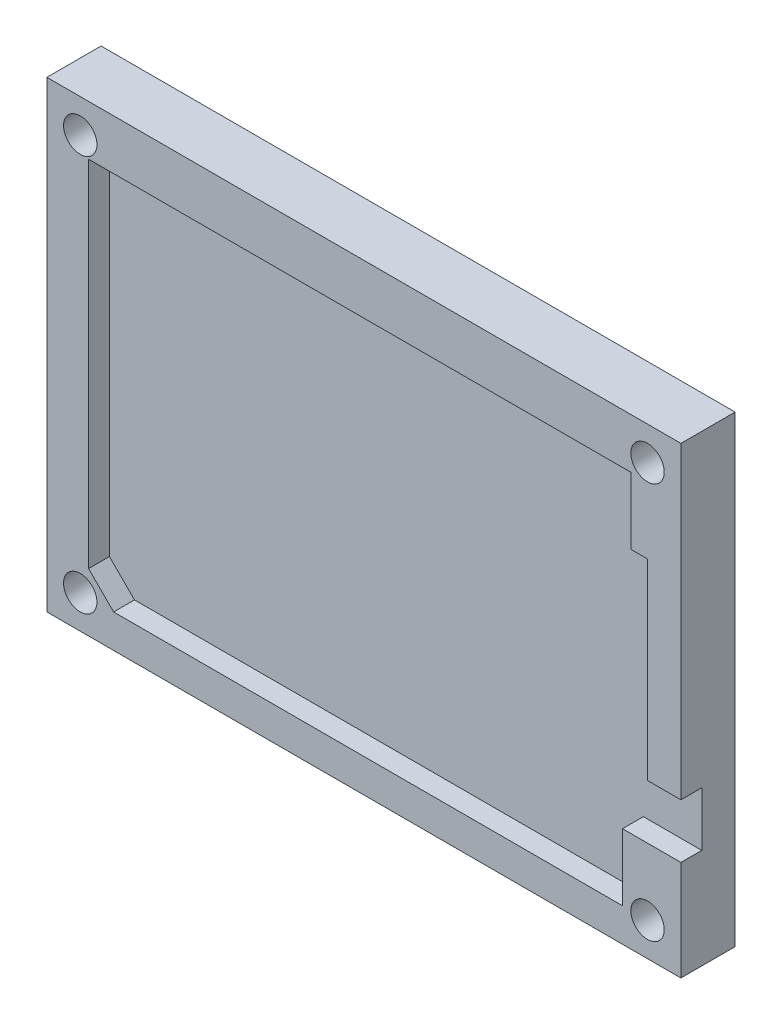
ISO-10303-21;
HEADER;
FILE_DESCRIPTION(('STEP AP214'),'2;1');
FILE_NAME('part.step','',(''),(''),'','','');
FILE_SCHEMA(('AUTOMOTIVE_DESIGN { 1 0 10303 214 1 1 1 1 }'));
ENDSEC;
DATA;
#1=APPLICATION_CONTEXT('core data for automotive mechanical design processes');
#2=APPLICATION_PROTOCOL_DEFINITION('international standard','automotive_design',2000,#1);
#3=PRODUCT_CONTEXT('',#1,'mechanical');
#4=PRODUCT('Part','Part','',(#3));
#5=PRODUCT_RELATED_PRODUCT_CATEGORY('part','',(#4));
#6=PRODUCT_DEFINITION_FORMATION('','',#4);
#7=PRODUCT_DEFINITION_CONTEXT('part definition',#1,'design');
#8=PRODUCT_DEFINITION('design','',#6,#7);
#9=PRODUCT_DEFINITION_SHAPE('','',#8);
#10=(LENGTH_UNIT() NAMED_UNIT(*) SI_UNIT(.MILLI.,.METRE.));
#11=(NAMED_UNIT(*) PLANE_ANGLE_UNIT() SI_UNIT($,.RADIAN.));
#12=(NAMED_UNIT(*) SI_UNIT($,.STERADIAN.) SOLID_ANGLE_UNIT());
#13=UNCERTAINTY_MEASURE_WITH_UNIT(LENGTH_MEASURE(1.E-05),#10,'distance_accuracy_value','');
#14=(GEOMETRIC_REPRESENTATION_CONTEXT(3) GLOBAL_UNCERTAINTY_ASSIGNED_CONTEXT((#13)) GLOBAL_UNIT_ASSIGNED_CONTEXT((#10,
#11,#12)) REPRESENTATION_CONTEXT('',''));
#15=CARTESIAN_POINT('',(0.,0.,0.));
#16=DIRECTION('',(0.,0.,1.));
#17=DIRECTION('',(1.,0.,0.));
#18=AXIS2_PLACEMENT_3D('',#15,#16,#17);
#19=CARTESIAN_POINT('',(-38.3610451306413,22.1591448931116,4.));
#20=DIRECTION('',(1.,0.,0.));
#21=DIRECTION('',(0.,1.,0.));
#22=AXIS2_PLACEMENT_3D('',#19,#20,#21);
#23=PLANE('',#22);
#24=DIRECTION('',(0.,-1.,0.));
#25=VECTOR('',#24,1.);
#26=CARTESIAN_POINT('',(-38.3610451306413,22.1591448931116,0.));
#27=LINE('',#26,#25);
#28=CARTESIAN_POINT('',(-38.3610451306413,22.1591448931116,0.));
#29=VERTEX_POINT('',#28);
#30=CARTESIAN_POINT('',(-38.3610451306413,-33.3408551068884,0.));
#31=VERTEX_POINT('',#30);
#32=EDGE_CURVE('E141',#29,#31,#27,.T.);
#33=ORIENTED_EDGE('',*,*,#32,.T.);
#34=DIRECTION('',(0.,0.,-1.));
#35=VECTOR('',#34,1.);
#36=CARTESIAN_POINT('',(-38.3610451306413,-33.3408551068884,4.));
#37=LINE('',#36,#35);
#38=CARTESIAN_POINT('',(-38.3610451306413,-33.3408551068884,6.5));
#39=VERTEX_POINT('',#38);
#40=EDGE_CURVE('E11',#39,#31,#37,.T.);
#41=ORIENTED_EDGE('',*,*,#40,.F.);
#42=DIRECTION('',(0.,-1.,0.));
#43=VECTOR('',#42,1.);
#44=CARTESIAN_POINT('',(-38.3610451306413,22.1591448931116,6.5));
#45=LINE('',#44,#43);
#46=CARTESIAN_POINT('',(-38.3610451306413,22.1591448931116,6.5));
#47=VERTEX_POINT('',#46);
#48=EDGE_CURVE('E139',#47,#39,#45,.T.);
#49=ORIENTED_EDGE('',*,*,#48,.F.);
#50=DIRECTION('',(0.,0.,-1.));
#51=VECTOR('',#50,1.);
#52=CARTESIAN_POINT('',(-38.3610451306413,22.1591448931116,4.));
#53=LINE('',#52,#51);
#54=EDGE_CURVE('E245',#47,#29,#53,.T.);
#55=ORIENTED_EDGE('',*,*,#54,.T.);
#56=EDGE_LOOP('',(#33,#41,#49,#55));
#57=FACE_BOUND('',#56,.T.);
#58=ADVANCED_FACE('F33',(#57),#23,.F.);
#59=CARTESIAN_POINT('',(-38.3610451306413,-33.3408551068884,4.));
#60=DIRECTION('',(0.,1.,0.));
#61=DIRECTION('',(0.,0.,1.));
#62=AXIS2_PLACEMENT_3D('',#59,#60,#61);
#63=PLANE('',#62);
#64=DIRECTION('',(1.,0.,0.));
#65=VECTOR('',#64,1.);
#66=CARTESIAN_POINT('',(-38.3610451306413,-33.3408551068884,0.));
#67=LINE('',#66,#65);
#68=CARTESIAN_POINT('',(37.6389548693587,-33.3408551068884,0.));
#69=VERTEX_POINT('',#68);
#70=EDGE_CURVE('E248',#31,#69,#67,.T.);
#71=ORIENTED_EDGE('',*,*,#70,.T.);
#72=DIRECTION('',(0.,0.,-1.));
#73=VECTOR('',#72,1.);
#74=CARTESIAN_POINT('',(37.6389548693587,-33.3408551068884,4.));
#75=LINE('',#74,#73);
#76=CARTESIAN_POINT('',(37.6389548693587,-33.3408551068884,6.5));
#77=VERTEX_POINT('',#76);
#78=EDGE_CURVE('E40',#77,#69,#75,.T.);
#79=ORIENTED_EDGE('',*,*,#78,.F.);
#80=DIRECTION('',(1.,0.,0.));
#81=VECTOR('',#80,1.);
#82=CARTESIAN_POINT('',(-38.3610451306413,-33.3408551068884,6.5));
#83=LINE('',#82,#81);
#84=EDGE_CURVE('E148',#39,#77,#83,.T.);
#85=ORIENTED_EDGE('',*,*,#84,.F.);
#86=ORIENTED_EDGE('',*,*,#40,.T.);
#87=EDGE_LOOP('',(#71,#79,#85,#86));
#88=FACE_BOUND('',#87,.T.);
#89=ADVANCED_FACE('F154',(#88),#63,.F.);
#90=CARTESIAN_POINT('',(37.6389548693587,22.1591448931116,4.));
#91=DIRECTION('',(-1.,0.,0.));
#92=DIRECTION('',(0.,-1.,0.));
#93=AXIS2_PLACEMENT_3D('',#90,#91,#92);
#94=PLANE('',#93);
#95=DIRECTION('',(0.,1.,0.));
#96=VECTOR('',#95,1.);
#97=CARTESIAN_POINT('',(37.6389548693587,22.1591448931116,0.));
#98=LINE('',#97,#96);
#99=CARTESIAN_POINT('',(37.6389548693587,22.1591448931116,0.));
#100=VERTEX_POINT('',#99);
#101=EDGE_CURVE('E250',#69,#100,#98,.T.);
#102=ORIENTED_EDGE('',*,*,#101,.T.);
#103=DIRECTION('',(0.,0.,-1.));
#104=VECTOR('',#103,1.);
#105=CARTESIAN_POINT('',(37.6389548693587,22.1591448931116,4.));
#106=LINE('',#105,#104);
#107=CARTESIAN_POINT('',(37.6389548693587,22.1591448931116,6.5));
#108=VERTEX_POINT('',#107);
#109=EDGE_CURVE('E254',#108,#100,#106,.T.);
#110=ORIENTED_EDGE('',*,*,#109,.F.);
#111=DIRECTION('',(0.,1.,0.));
#112=VECTOR('',#111,1.);
#113=CARTESIAN_POINT('',(37.6389548693587,8.15914489311163,6.5));
#114=LINE('',#113,#112);
#115=CARTESIAN_POINT('',(37.6389548693587,-14.8408551068884,6.5));
#116=VERTEX_POINT('',#115);
#117=EDGE_CURVE('E181',#116,#108,#114,.T.);
#118=ORIENTED_EDGE('',*,*,#117,.F.);
#119=DIRECTION('',(0.,0.,-1.));
#120=VECTOR('',#119,1.);
#121=CARTESIAN_POINT('',(37.6389548693587,-14.8408551068884,6.5));
#122=LINE('',#121,#120);
#123=CARTESIAN_POINT('',(37.6389548693587,-14.8408551068884,4.));
#124=VERTEX_POINT('',#123);
#125=EDGE_CURVE('E184',#116,#124,#122,.T.);
#126=ORIENTED_EDGE('',*,*,#125,.T.);
#127=DIRECTION('',(0.,1.,0.));
#128=VECTOR('',#127,1.);
#129=CARTESIAN_POINT('',(37.6389548693587,22.1591448931116,4.));
#130=LINE('',#129,#128);
#131=CARTESIAN_POINT('',(37.6389548693587,-21.3408551068884,4.));
#132=VERTEX_POINT('',#131);
#133=EDGE_CURVE('E243',#132,#124,#130,.T.);
#134=ORIENTED_EDGE('',*,*,#133,.F.);
#135=DIRECTION('',(0.,0.,-1.));
#136=VECTOR('',#135,1.);
#137=CARTESIAN_POINT('',(37.6389548693587,-21.3408551068884,6.5));
#138=LINE('',#137,#136);
#139=CARTESIAN_POINT('',(37.6389548693587,-21.3408551068884,6.5));
#140=VERTEX_POINT('',#139);
#141=EDGE_CURVE('E240',#140,#132,#138,.T.);
#142=ORIENTED_EDGE('',*,*,#141,.F.);
#143=DIRECTION('',(0.,1.,0.));
#144=VECTOR('',#143,1.);
#145=CARTESIAN_POINT('',(37.6389548693587,-33.3408551068884,6.5));
#146=LINE('',#145,#144);
#147=EDGE_CURVE('E156',#77,#140,#146,.T.);
#148=ORIENTED_EDGE('',*,*,#147,.F.);
#149=ORIENTED_EDGE('',*,*,#78,.T.);
#150=EDGE_LOOP('',(#102,#110,#118,#126,#134,#142,#148,#149));
#151=FACE_BOUND('',#150,.T.);
#152=ADVANCED_FACE('F258',(#151),#94,.F.);
#153=CARTESIAN_POINT('',(-38.3610451306413,22.1591448931116,4.));
#154=DIRECTION('',(0.,-1.,0.));
#155=DIRECTION('',(0.,0.,-1.));
#156=AXIS2_PLACEMENT_3D('',#153,#154,#155);
#157=PLANE('',#156);
#158=DIRECTION('',(-1.,0.,0.));
#159=VECTOR('',#158,1.);
#160=CARTESIAN_POINT('',(-38.3610451306413,22.1591448931116,0.));
#161=LINE('',#160,#159);
#162=EDGE_CURVE('E246',#100,#29,#161,.T.);
#163=ORIENTED_EDGE('',*,*,#162,.T.);
#164=ORIENTED_EDGE('',*,*,#54,.F.);
#165=DIRECTION('',(-1.,0.,0.));
#166=VECTOR('',#165,1.);
#167=CARTESIAN_POINT('',(-38.3610451306413,22.1591448931116,6.5));
#168=LINE('',#167,#166);
#169=EDGE_CURVE('E152',#108,#47,#168,.T.);
#170=ORIENTED_EDGE('',*,*,#169,.F.);
#171=ORIENTED_EDGE('',*,*,#109,.T.);
#172=EDGE_LOOP('',(#163,#164,#170,#171));
#173=FACE_BOUND('',#172,.T.);
#174=ADVANCED_FACE('F264',(#173),#157,.F.);
#175=CARTESIAN_POINT('',(0.,0.,4.));
#176=DIRECTION('',(0.,0.,1.));
#177=DIRECTION('',(1.,0.,0.));
#178=AXIS2_PLACEMENT_3D('',#175,#176,#177);
#179=PLANE('',#178);
#180=DIRECTION('',(1.,0.,0.));
#181=VECTOR('',#180,1.);
#182=CARTESIAN_POINT('',(37.6389548693587,-14.8408551068884,4.));
#183=LINE('',#182,#181);
#184=CARTESIAN_POINT('',(33.6389548693587,-14.8408551068884,4.));
#185=VERTEX_POINT('',#184);
#186=EDGE_CURVE('E47',#185,#124,#183,.T.);
#187=ORIENTED_EDGE('',*,*,#186,.F.);
#188=DIRECTION('',(0.,-1.,0.));
#189=VECTOR('',#188,1.);
#190=CARTESIAN_POINT('',(33.6389548693587,8.15914489311163,4.));
#191=LINE('',#190,#189);
#192=CARTESIAN_POINT('',(33.6389548693587,8.15914489311163,4.));
#193=VERTEX_POINT('',#192);
#194=EDGE_CURVE('E51',#193,#185,#191,.T.);
#195=ORIENTED_EDGE('',*,*,#194,.F.);
#196=DIRECTION('',(1.,0.,0.));
#197=VECTOR('',#196,1.);
#198=CARTESIAN_POINT('',(33.6389548693587,8.15914489311163,4.));
#199=LINE('',#198,#197);
#200=CARTESIAN_POINT('',(31.6389548693587,8.15914489311163,4.));
#201=VERTEX_POINT('',#200);
#202=EDGE_CURVE('E207',#201,#193,#199,.T.);
#203=ORIENTED_EDGE('',*,*,#202,.F.);
#204=DIRECTION('',(0.,-1.,0.));
#205=VECTOR('',#204,1.);
#206=CARTESIAN_POINT('',(31.6389548693587,16.1591448931116,4.));
#207=LINE('',#206,#205);
#208=CARTESIAN_POINT('',(31.6389548693587,16.1591448931116,4.));
#209=VERTEX_POINT('',#208);
#210=EDGE_CURVE('E204',#209,#201,#207,.T.);
#211=ORIENTED_EDGE('',*,*,#210,.F.);
#212=DIRECTION('',(1.,0.,0.));
#213=VECTOR('',#212,1.);
#214=CARTESIAN_POINT('',(-33.3610451306413,16.1591448931116,4.));
#215=LINE('',#214,#213);
#216=CARTESIAN_POINT('',(-33.3610451306413,16.1591448931116,4.));
#217=VERTEX_POINT('',#216);
#218=EDGE_CURVE('E201',#217,#209,#215,.T.);
#219=ORIENTED_EDGE('',*,*,#218,.F.);
#220=DIRECTION('',(0.,1.,0.));
#221=VECTOR('',#220,1.);
#222=CARTESIAN_POINT('',(-33.3610451306413,16.1591448931116,4.));
#223=LINE('',#222,#221);
#224=CARTESIAN_POINT('',(-33.3610451306413,-26.3408551068884,4.));
#225=VERTEX_POINT('',#224);
#226=EDGE_CURVE('E198',#225,#217,#223,.T.);
#227=ORIENTED_EDGE('',*,*,#226,.F.);
#228=DIRECTION('',(-0.707106781186547,0.707106781186548,0.));
#229=VECTOR('',#228,1.);
#230=CARTESIAN_POINT('',(-33.3610451306413,-26.3408551068884,4.));
#231=LINE('',#230,#229);
#232=CARTESIAN_POINT('',(-30.3610451306413,-29.3408551068884,4.));
#233=VERTEX_POINT('',#232);
#234=EDGE_CURVE('E195',#233,#225,#231,.T.);
#235=ORIENTED_EDGE('',*,*,#234,.F.);
#236=DIRECTION('',(-1.,0.,0.));
#237=VECTOR('',#236,1.);
#238=CARTESIAN_POINT('',(-30.3610451306413,-29.3408551068884,4.));
#239=LINE('',#238,#237);
#240=CARTESIAN_POINT('',(30.6389548693587,-29.3408551068884,4.));
#241=VERTEX_POINT('',#240);
#242=EDGE_CURVE('E192',#241,#233,#239,.T.);
#243=ORIENTED_EDGE('',*,*,#242,.F.);
#244=DIRECTION('',(0.,-1.,0.));
#245=VECTOR('',#244,1.);
#246=CARTESIAN_POINT('',(30.6389548693587,-29.3408551068884,4.));
#247=LINE('',#246,#245);
#248=CARTESIAN_POINT('',(30.6389548693587,-21.3408551068884,4.));
#249=VERTEX_POINT('',#248);
#250=EDGE_CURVE('E188',#249,#241,#247,.T.);
#251=ORIENTED_EDGE('',*,*,#250,.F.);
#252=DIRECTION('',(-1.,0.,0.));
#253=VECTOR('',#252,1.);
#254=CARTESIAN_POINT('',(37.6389548693587,-21.3408551068884,4.));
#255=LINE('',#254,#253);
#256=EDGE_CURVE('E185',#132,#249,#255,.T.);
#257=ORIENTED_EDGE('',*,*,#256,.F.);
#258=ORIENTED_EDGE('',*,*,#133,.T.);
#259=EDGE_LOOP('',(#187,#195,#203,#211,#219,#227,#235,#243,#251,#257,#258));
#260=FACE_BOUND('',#259,.T.);
#261=ADVANCED_FACE('F327',(#260),#179,.T.);
#262=CARTESIAN_POINT('',(0.,0.,0.));
#263=DIRECTION('',(0.,0.,1.));
#264=DIRECTION('',(1.,0.,0.));
#265=AXIS2_PLACEMENT_3D('',#262,#263,#264);
#266=PLANE('',#265);
#267=CARTESIAN_POINT('',(-34.3610451306413,18.1591448931116,0.));
#268=DIRECTION('',(0.,0.,1.));
#269=DIRECTION('',(1.,0.,0.));
#270=AXIS2_PLACEMENT_3D('',#267,#268,#269);
#271=CIRCLE('',#270,2.);
#272=CARTESIAN_POINT('',(-32.3610451306413,18.1591448931116,0.));
#273=VERTEX_POINT('',#272);
#274=EDGE_CURVE('E424',#273,#273,#271,.T.);
#275=ORIENTED_EDGE('',*,*,#274,.T.);
#276=EDGE_LOOP('',(#275));
#277=FACE_BOUND('',#276,.T.);
#278=CARTESIAN_POINT('',(33.6389548693587,18.1591448931116,0.));
#279=DIRECTION('',(0.,0.,1.));
#280=DIRECTION('',(1.,0.,0.));
#281=AXIS2_PLACEMENT_3D('',#278,#279,#280);
#282=CIRCLE('',#281,2.);
#283=CARTESIAN_POINT('',(35.6389548693587,18.1591448931116,0.));
#284=VERTEX_POINT('',#283);
#285=EDGE_CURVE('E434',#284,#284,#282,.T.);
#286=ORIENTED_EDGE('',*,*,#285,.T.);
#287=EDGE_LOOP('',(#286));
#288=FACE_BOUND('',#287,.T.);
#289=CARTESIAN_POINT('',(33.6389548693587,-29.3408551068884,0.));
#290=DIRECTION('',(0.,0.,1.));
#291=DIRECTION('',(1.,0.,0.));
#292=AXIS2_PLACEMENT_3D('',#289,#290,#291);
#293=CIRCLE('',#292,2.);
#294=CARTESIAN_POINT('',(35.6389548693587,-29.3408551068884,0.));
#295=VERTEX_POINT('',#294);
#296=EDGE_CURVE('E440',#295,#295,#293,.T.);
#297=ORIENTED_EDGE('',*,*,#296,.T.);
#298=EDGE_LOOP('',(#297));
#299=FACE_BOUND('',#298,.T.);
#300=CARTESIAN_POINT('',(-34.3610451306413,-29.3408551068884,0.));
#301=DIRECTION('',(0.,0.,1.));
#302=DIRECTION('',(1.,0.,0.));
#303=AXIS2_PLACEMENT_3D('',#300,#301,#302);
#304=CIRCLE('',#303,2.);
#305=CARTESIAN_POINT('',(-32.3610451306413,-29.3408551068884,0.));
#306=VERTEX_POINT('',#305);
#307=EDGE_CURVE('E189',#306,#306,#304,.T.);
#308=ORIENTED_EDGE('',*,*,#307,.T.);
#309=EDGE_LOOP('',(#308));
#310=FACE_BOUND('',#309,.T.);
#311=ORIENTED_EDGE('',*,*,#32,.F.);
#312=ORIENTED_EDGE('',*,*,#162,.F.);
#313=ORIENTED_EDGE('',*,*,#101,.F.);
#314=ORIENTED_EDGE('',*,*,#70,.F.);
#315=EDGE_LOOP('',(#311,#312,#313,#314));
#316=FACE_BOUND('',#315,.T.);
#317=ADVANCED_FACE('F262',(#277,#288,#299,#310,#316),#266,.F.);
#318=CARTESIAN_POINT('',(37.6389548693587,-21.3408551068884,6.5));
#319=DIRECTION('',(0.,-1.,0.));
#320=DIRECTION('',(0.,0.,-1.));
#321=AXIS2_PLACEMENT_3D('',#318,#319,#320);
#322=PLANE('',#321);
#323=ORIENTED_EDGE('',*,*,#256,.T.);
#324=DIRECTION('',(0.,0.,-1.));
#325=VECTOR('',#324,1.);
#326=CARTESIAN_POINT('',(30.6389548693587,-21.3408551068884,6.5));
#327=LINE('',#326,#325);
#328=CARTESIAN_POINT('',(30.6389548693587,-21.3408551068884,6.5));
#329=VERTEX_POINT('',#328);
#330=EDGE_CURVE('E237',#329,#249,#327,.T.);
#331=ORIENTED_EDGE('',*,*,#330,.F.);
#332=DIRECTION('',(-1.,0.,0.));
#333=VECTOR('',#332,1.);
#334=CARTESIAN_POINT('',(37.6389548693587,-21.3408551068884,6.5));
#335=LINE('',#334,#333);
#336=EDGE_CURVE('E158',#140,#329,#335,.T.);
#337=ORIENTED_EDGE('',*,*,#336,.F.);
#338=ORIENTED_EDGE('',*,*,#141,.T.);
#339=EDGE_LOOP('',(#323,#331,#337,#338));
#340=FACE_BOUND('',#339,.T.);
#341=ADVANCED_FACE('F275',(#340),#322,.F.);
#342=CARTESIAN_POINT('',(30.6389548693587,-29.3408551068884,6.5));
#343=DIRECTION('',(1.,0.,0.));
#344=DIRECTION('',(0.,1.,0.));
#345=AXIS2_PLACEMENT_3D('',#342,#343,#344);
#346=PLANE('',#345);
#347=ORIENTED_EDGE('',*,*,#250,.T.);
#348=DIRECTION('',(0.,0.,-1.));
#349=VECTOR('',#348,1.);
#350=CARTESIAN_POINT('',(30.6389548693587,-29.3408551068884,6.5));
#351=LINE('',#350,#349);
#352=CARTESIAN_POINT('',(30.6389548693587,-29.3408551068884,6.5));
#353=VERTEX_POINT('',#352);
#354=EDGE_CURVE('E234',#353,#241,#351,.T.);
#355=ORIENTED_EDGE('',*,*,#354,.F.);
#356=DIRECTION('',(0.,-1.,0.));
#357=VECTOR('',#356,1.);
#358=CARTESIAN_POINT('',(30.6389548693587,-29.3408551068884,6.5));
#359=LINE('',#358,#357);
#360=EDGE_CURVE('E163',#329,#353,#359,.T.);
#361=ORIENTED_EDGE('',*,*,#360,.F.);
#362=ORIENTED_EDGE('',*,*,#330,.T.);
#363=EDGE_LOOP('',(#347,#355,#361,#362));
#364=FACE_BOUND('',#363,.T.);
#365=ADVANCED_FACE('F282',(#364),#346,.F.);
#366=CARTESIAN_POINT('',(-30.3610451306413,-29.3408551068884,6.5));
#367=DIRECTION('',(0.,-1.,0.));
#368=DIRECTION('',(1.,0.,0.));
#369=AXIS2_PLACEMENT_3D('',#366,#367,#368);
#370=PLANE('',#369);
#371=ORIENTED_EDGE('',*,*,#242,.T.);
#372=DIRECTION('',(0.,0.,-1.));
#373=VECTOR('',#372,1.);
#374=CARTESIAN_POINT('',(-30.3610451306413,-29.3408551068884,6.5));
#375=LINE('',#374,#373);
#376=CARTESIAN_POINT('',(-30.3610451306413,-29.3408551068884,6.5));
#377=VERTEX_POINT('',#376);
#378=EDGE_CURVE('E231',#377,#233,#375,.T.);
#379=ORIENTED_EDGE('',*,*,#378,.F.);
#380=DIRECTION('',(-1.,0.,0.));
#381=VECTOR('',#380,1.);
#382=CARTESIAN_POINT('',(-30.3610451306413,-29.3408551068884,6.5));
#383=LINE('',#382,#381);
#384=EDGE_CURVE('E165',#353,#377,#383,.T.);
#385=ORIENTED_EDGE('',*,*,#384,.F.);
#386=ORIENTED_EDGE('',*,*,#354,.T.);
#387=EDGE_LOOP('',(#371,#379,#385,#386));
#388=FACE_BOUND('',#387,.T.);
#389=ADVANCED_FACE('F284',(#388),#370,.F.);
#390=CARTESIAN_POINT('',(-33.3610451306413,-26.3408551068884,6.5));
#391=DIRECTION('',(-0.707106781186548,-0.707106781186547,0.));
#392=DIRECTION('',(0.707106781186547,-0.707106781186548,0.));
#393=AXIS2_PLACEMENT_3D('',#390,#391,#392);
#394=PLANE('',#393);
#395=ORIENTED_EDGE('',*,*,#234,.T.);
#396=DIRECTION('',(0.,0.,-1.));
#397=VECTOR('',#396,1.);
#398=CARTESIAN_POINT('',(-33.3610451306413,-26.3408551068884,6.5));
#399=LINE('',#398,#397);
#400=CARTESIAN_POINT('',(-33.3610451306413,-26.3408551068884,6.5));
#401=VERTEX_POINT('',#400);
#402=EDGE_CURVE('E228',#401,#225,#399,.T.);
#403=ORIENTED_EDGE('',*,*,#402,.F.);
#404=DIRECTION('',(-0.707106781186547,0.707106781186548,0.));
#405=VECTOR('',#404,1.);
#406=CARTESIAN_POINT('',(-33.3610451306413,-26.3408551068884,6.5));
#407=LINE('',#406,#405);
#408=EDGE_CURVE('E167',#377,#401,#407,.T.);
#409=ORIENTED_EDGE('',*,*,#408,.F.);
#410=ORIENTED_EDGE('',*,*,#378,.T.);
#411=EDGE_LOOP('',(#395,#403,#409,#410));
#412=FACE_BOUND('',#411,.T.);
#413=ADVANCED_FACE('F288',(#412),#394,.F.);
#414=CARTESIAN_POINT('',(-33.3610451306413,16.1591448931116,6.5));
#415=DIRECTION('',(-1.,0.,0.));
#416=DIRECTION('',(0.,-1.,0.));
#417=AXIS2_PLACEMENT_3D('',#414,#415,#416);
#418=PLANE('',#417);
#419=ORIENTED_EDGE('',*,*,#226,.T.);
#420=DIRECTION('',(0.,0.,-1.));
#421=VECTOR('',#420,1.);
#422=CARTESIAN_POINT('',(-33.3610451306413,16.1591448931116,6.5));
#423=LINE('',#422,#421);
#424=CARTESIAN_POINT('',(-33.3610451306413,16.1591448931116,6.5));
#425=VERTEX_POINT('',#424);
#426=EDGE_CURVE('E225',#425,#217,#423,.T.);
#427=ORIENTED_EDGE('',*,*,#426,.F.);
#428=DIRECTION('',(0.,1.,0.));
#429=VECTOR('',#428,1.);
#430=CARTESIAN_POINT('',(-33.3610451306413,16.1591448931116,6.5));
#431=LINE('',#430,#429);
#432=EDGE_CURVE('E169',#401,#425,#431,.T.);
#433=ORIENTED_EDGE('',*,*,#432,.F.);
#434=ORIENTED_EDGE('',*,*,#402,.T.);
#435=EDGE_LOOP('',(#419,#427,#433,#434));
#436=FACE_BOUND('',#435,.T.);
#437=ADVANCED_FACE('F294',(#436),#418,.F.);
#438=CARTESIAN_POINT('',(-33.3610451306413,16.1591448931116,6.5));
#439=DIRECTION('',(0.,1.,0.));
#440=DIRECTION('',(0.,0.,1.));
#441=AXIS2_PLACEMENT_3D('',#438,#439,#440);
#442=PLANE('',#441);
#443=ORIENTED_EDGE('',*,*,#218,.T.);
#444=DIRECTION('',(0.,0.,-1.));
#445=VECTOR('',#444,1.);
#446=CARTESIAN_POINT('',(31.6389548693587,16.1591448931116,6.5));
#447=LINE('',#446,#445);
#448=CARTESIAN_POINT('',(31.6389548693587,16.1591448931116,6.5));
#449=VERTEX_POINT('',#448);
#450=EDGE_CURVE('E222',#449,#209,#447,.T.);
#451=ORIENTED_EDGE('',*,*,#450,.F.);
#452=DIRECTION('',(1.,0.,0.));
#453=VECTOR('',#452,1.);
#454=CARTESIAN_POINT('',(-33.3610451306413,16.1591448931116,6.5));
#455=LINE('',#454,#453);
#456=EDGE_CURVE('E171',#425,#449,#455,.T.);
#457=ORIENTED_EDGE('',*,*,#456,.F.);
#458=ORIENTED_EDGE('',*,*,#426,.T.);
#459=EDGE_LOOP('',(#443,#451,#457,#458));
#460=FACE_BOUND('',#459,.T.);
#461=ADVANCED_FACE('F296',(#460),#442,.F.);
#462=CARTESIAN_POINT('',(31.6389548693587,16.1591448931116,6.5));
#463=DIRECTION('',(1.,0.,0.));
#464=DIRECTION('',(0.,0.,-1.));
#465=AXIS2_PLACEMENT_3D('',#462,#463,#464);
#466=PLANE('',#465);
#467=ORIENTED_EDGE('',*,*,#210,.T.);
#468=DIRECTION('',(0.,0.,-1.));
#469=VECTOR('',#468,1.);
#470=CARTESIAN_POINT('',(31.6389548693587,8.15914489311163,6.5));
#471=LINE('',#470,#469);
#472=CARTESIAN_POINT('',(31.6389548693587,8.15914489311163,6.5));
#473=VERTEX_POINT('',#472);
#474=EDGE_CURVE('E219',#473,#201,#471,.T.);
#475=ORIENTED_EDGE('',*,*,#474,.F.);
#476=DIRECTION('',(0.,-1.,0.));
#477=VECTOR('',#476,1.);
#478=CARTESIAN_POINT('',(31.6389548693587,16.1591448931116,6.5));
#479=LINE('',#478,#477);
#480=EDGE_CURVE('E173',#449,#473,#479,.T.);
#481=ORIENTED_EDGE('',*,*,#480,.F.);
#482=ORIENTED_EDGE('',*,*,#450,.T.);
#483=EDGE_LOOP('',(#467,#475,#481,#482));
#484=FACE_BOUND('',#483,.T.);
#485=ADVANCED_FACE('F300',(#484),#466,.F.);
#486=CARTESIAN_POINT('',(33.6389548693587,8.15914489311163,6.5));
#487=DIRECTION('',(0.,1.,0.));
#488=DIRECTION('',(0.,0.,1.));
#489=AXIS2_PLACEMENT_3D('',#486,#487,#488);
#490=PLANE('',#489);
#491=ORIENTED_EDGE('',*,*,#202,.T.);
#492=DIRECTION('',(0.,0.,-1.));
#493=VECTOR('',#492,1.);
#494=CARTESIAN_POINT('',(33.6389548693587,8.15914489311163,6.5));
#495=LINE('',#494,#493);
#496=CARTESIAN_POINT('',(33.6389548693587,8.15914489311163,6.5));
#497=VERTEX_POINT('',#496);
#498=EDGE_CURVE('E216',#497,#193,#495,.T.);
#499=ORIENTED_EDGE('',*,*,#498,.F.);
#500=DIRECTION('',(1.,0.,0.));
#501=VECTOR('',#500,1.);
#502=CARTESIAN_POINT('',(33.6389548693587,8.15914489311163,6.5));
#503=LINE('',#502,#501);
#504=EDGE_CURVE('E175',#473,#497,#503,.T.);
#505=ORIENTED_EDGE('',*,*,#504,.F.);
#506=ORIENTED_EDGE('',*,*,#474,.T.);
#507=EDGE_LOOP('',(#491,#499,#505,#506));
#508=FACE_BOUND('',#507,.T.);
#509=ADVANCED_FACE('F304',(#508),#490,.F.);
#510=CARTESIAN_POINT('',(33.6389548693587,8.15914489311163,6.5));
#511=DIRECTION('',(1.,0.,0.));
#512=DIRECTION('',(0.,0.,-1.));
#513=AXIS2_PLACEMENT_3D('',#510,#511,#512);
#514=PLANE('',#513);
#515=ORIENTED_EDGE('',*,*,#194,.T.);
#516=DIRECTION('',(0.,0.,-1.));
#517=VECTOR('',#516,1.);
#518=CARTESIAN_POINT('',(33.6389548693587,-14.8408551068884,6.5));
#519=LINE('',#518,#517);
#520=CARTESIAN_POINT('',(33.6389548693587,-14.8408551068884,6.5));
#521=VERTEX_POINT('',#520);
#522=EDGE_CURVE('E213',#521,#185,#519,.T.);
#523=ORIENTED_EDGE('',*,*,#522,.F.);
#524=DIRECTION('',(0.,-1.,0.));
#525=VECTOR('',#524,1.);
#526=CARTESIAN_POINT('',(33.6389548693587,8.15914489311163,6.5));
#527=LINE('',#526,#525);
#528=EDGE_CURVE('E177',#497,#521,#527,.T.);
#529=ORIENTED_EDGE('',*,*,#528,.F.);
#530=ORIENTED_EDGE('',*,*,#498,.T.);
#531=EDGE_LOOP('',(#515,#523,#529,#530));
#532=FACE_BOUND('',#531,.T.);
#533=ADVANCED_FACE('F306',(#532),#514,.F.);
#534=CARTESIAN_POINT('',(37.6389548693587,-14.8408551068884,6.5));
#535=DIRECTION('',(0.,1.,0.));
#536=DIRECTION('',(0.,0.,1.));
#537=AXIS2_PLACEMENT_3D('',#534,#535,#536);
#538=PLANE('',#537);
#539=ORIENTED_EDGE('',*,*,#186,.T.);
#540=ORIENTED_EDGE('',*,*,#125,.F.);
#541=DIRECTION('',(1.,0.,0.));
#542=VECTOR('',#541,1.);
#543=CARTESIAN_POINT('',(37.6389548693587,-14.8408551068884,6.5));
#544=LINE('',#543,#542);
#545=EDGE_CURVE('E179',#521,#116,#544,.T.);
#546=ORIENTED_EDGE('',*,*,#545,.F.);
#547=ORIENTED_EDGE('',*,*,#522,.T.);
#548=EDGE_LOOP('',(#539,#540,#546,#547));
#549=FACE_BOUND('',#548,.T.);
#550=ADVANCED_FACE('F271',(#549),#538,.F.);
#551=CARTESIAN_POINT('',(0.,0.,6.5));
#552=DIRECTION('',(0.,0.,1.));
#553=DIRECTION('',(1.,0.,0.));
#554=AXIS2_PLACEMENT_3D('',#551,#552,#553);
#555=PLANE('',#554);
#556=CARTESIAN_POINT('',(-34.3610451306413,18.1591448931116,6.5));
#557=DIRECTION('',(0.,0.,1.));
#558=DIRECTION('',(1.,0.,0.));
#559=AXIS2_PLACEMENT_3D('',#556,#557,#558);
#560=CIRCLE('',#559,2.);
#561=CARTESIAN_POINT('',(-32.3610451306413,18.1591448931116,6.5));
#562=VERTEX_POINT('',#561);
#563=EDGE_CURVE('E427',#562,#562,#560,.T.);
#564=ORIENTED_EDGE('',*,*,#563,.F.);
#565=EDGE_LOOP('',(#564));
#566=FACE_BOUND('',#565,.T.);
#567=CARTESIAN_POINT('',(33.6389548693587,18.1591448931116,6.5));
#568=DIRECTION('',(0.,0.,1.));
#569=DIRECTION('',(1.,0.,0.));
#570=AXIS2_PLACEMENT_3D('',#567,#568,#569);
#571=CIRCLE('',#570,2.);
#572=CARTESIAN_POINT('',(35.6389548693587,18.1591448931116,6.5));
#573=VERTEX_POINT('',#572);
#574=EDGE_CURVE('E429',#573,#573,#571,.T.);
#575=ORIENTED_EDGE('',*,*,#574,.F.);
#576=EDGE_LOOP('',(#575));
#577=FACE_BOUND('',#576,.T.);
#578=CARTESIAN_POINT('',(33.6389548693587,-29.3408551068884,6.5));
#579=DIRECTION('',(0.,0.,1.));
#580=DIRECTION('',(1.,0.,0.));
#581=AXIS2_PLACEMENT_3D('',#578,#579,#580);
#582=CIRCLE('',#581,2.);
#583=CARTESIAN_POINT('',(35.6389548693587,-29.3408551068884,6.5));
#584=VERTEX_POINT('',#583);
#585=EDGE_CURVE('E437',#584,#584,#582,.T.);
#586=ORIENTED_EDGE('',*,*,#585,.F.);
#587=EDGE_LOOP('',(#586));
#588=FACE_BOUND('',#587,.T.);
#589=CARTESIAN_POINT('',(-34.3610451306413,-29.3408551068884,6.5));
#590=DIRECTION('',(0.,0.,1.));
#591=DIRECTION('',(1.,0.,0.));
#592=AXIS2_PLACEMENT_3D('',#589,#590,#591);
#593=CIRCLE('',#592,2.);
#594=CARTESIAN_POINT('',(-32.3610451306413,-29.3408551068884,6.5));
#595=VERTEX_POINT('',#594);
#596=EDGE_CURVE('E443',#595,#595,#593,.T.);
#597=ORIENTED_EDGE('',*,*,#596,.F.);
#598=EDGE_LOOP('',(#597));
#599=FACE_BOUND('',#598,.T.);
#600=ORIENTED_EDGE('',*,*,#48,.T.);
#601=ORIENTED_EDGE('',*,*,#84,.T.);
#602=ORIENTED_EDGE('',*,*,#147,.T.);
#603=ORIENTED_EDGE('',*,*,#336,.T.);
#604=ORIENTED_EDGE('',*,*,#360,.T.);
#605=ORIENTED_EDGE('',*,*,#384,.T.);
#606=ORIENTED_EDGE('',*,*,#408,.T.);
#607=ORIENTED_EDGE('',*,*,#432,.T.);
#608=ORIENTED_EDGE('',*,*,#456,.T.);
#609=ORIENTED_EDGE('',*,*,#480,.T.);
#610=ORIENTED_EDGE('',*,*,#504,.T.);
#611=ORIENTED_EDGE('',*,*,#528,.T.);
#612=ORIENTED_EDGE('',*,*,#545,.T.);
#613=ORIENTED_EDGE('',*,*,#117,.T.);
#614=ORIENTED_EDGE('',*,*,#169,.T.);
#615=EDGE_LOOP('',(#600,#601,#602,#603,#604,#605,#606,#607,#608,#609,#610,#611,#612,#613,#614));
#616=FACE_BOUND('',#615,.T.);
#617=ADVANCED_FACE('F147',(#566,#577,#588,#599,#616),#555,.T.);
#618=CARTESIAN_POINT('',(-34.3610451306413,-29.3408551068884,6.5));
#619=DIRECTION('',(0.,0.,1.));
#620=DIRECTION('',(1.,0.,0.));
#621=AXIS2_PLACEMENT_3D('',#618,#619,#620);
#622=CYLINDRICAL_SURFACE('',#621,2.);
#623=ORIENTED_EDGE('',*,*,#307,.F.);
#624=EDGE_LOOP('',(#623));
#625=FACE_BOUND('',#624,.T.);
#626=ORIENTED_EDGE('',*,*,#596,.T.);
#627=EDGE_LOOP('',(#626));
#628=FACE_BOUND('',#627,.T.);
#629=ADVANCED_FACE('F377',(#625,#628),#622,.F.);
#630=CARTESIAN_POINT('',(33.6389548693587,-29.3408551068884,6.5));
#631=DIRECTION('',(0.,0.,1.));
#632=DIRECTION('',(1.,0.,0.));
#633=AXIS2_PLACEMENT_3D('',#630,#631,#632);
#634=CYLINDRICAL_SURFACE('',#633,2.);
#635=ORIENTED_EDGE('',*,*,#296,.F.);
#636=EDGE_LOOP('',(#635));
#637=FACE_BOUND('',#636,.T.);
#638=ORIENTED_EDGE('',*,*,#585,.T.);
#639=EDGE_LOOP('',(#638));
#640=FACE_BOUND('',#639,.T.);
#641=ADVANCED_FACE('F387',(#637,#640),#634,.F.);
#642=CARTESIAN_POINT('',(33.6389548693587,18.1591448931116,6.5));
#643=DIRECTION('',(0.,0.,1.));
#644=DIRECTION('',(1.,0.,0.));
#645=AXIS2_PLACEMENT_3D('',#642,#643,#644);
#646=CYLINDRICAL_SURFACE('',#645,2.);
#647=ORIENTED_EDGE('',*,*,#285,.F.);
#648=EDGE_LOOP('',(#647));
#649=FACE_BOUND('',#648,.T.);
#650=ORIENTED_EDGE('',*,*,#574,.T.);
#651=EDGE_LOOP('',(#650));
#652=FACE_BOUND('',#651,.T.);
#653=ADVANCED_FACE('F397',(#649,#652),#646,.F.);
#654=CARTESIAN_POINT('',(-34.3610451306413,18.1591448931116,6.5));
#655=DIRECTION('',(0.,0.,1.));
#656=DIRECTION('',(1.,0.,0.));
#657=AXIS2_PLACEMENT_3D('',#654,#655,#656);
#658=CYLINDRICAL_SURFACE('',#657,2.);
#659=ORIENTED_EDGE('',*,*,#274,.F.);
#660=EDGE_LOOP('',(#659));
#661=FACE_BOUND('',#660,.T.);
#662=ORIENTED_EDGE('',*,*,#563,.T.);
#663=EDGE_LOOP('',(#662));
#664=FACE_BOUND('',#663,.T.);
#665=ADVANCED_FACE('F407',(#661,#664),#658,.F.);
#666=CLOSED_SHELL('',(#58,#89,#152,#174,#261,#317,#341,#365,#389,#413,#437,#461,#485,#509,#533,
#550,#617,#629,#641,#653,#665));
#667=MANIFOLD_SOLID_BREP('B2',#666);
#668=ADVANCED_BREP_SHAPE_REPRESENTATION('',(#18,#667),#14);
#669=SHAPE_DEFINITION_REPRESENTATION(#9,#668);
ENDSEC;
END-ISO-10303-21;
